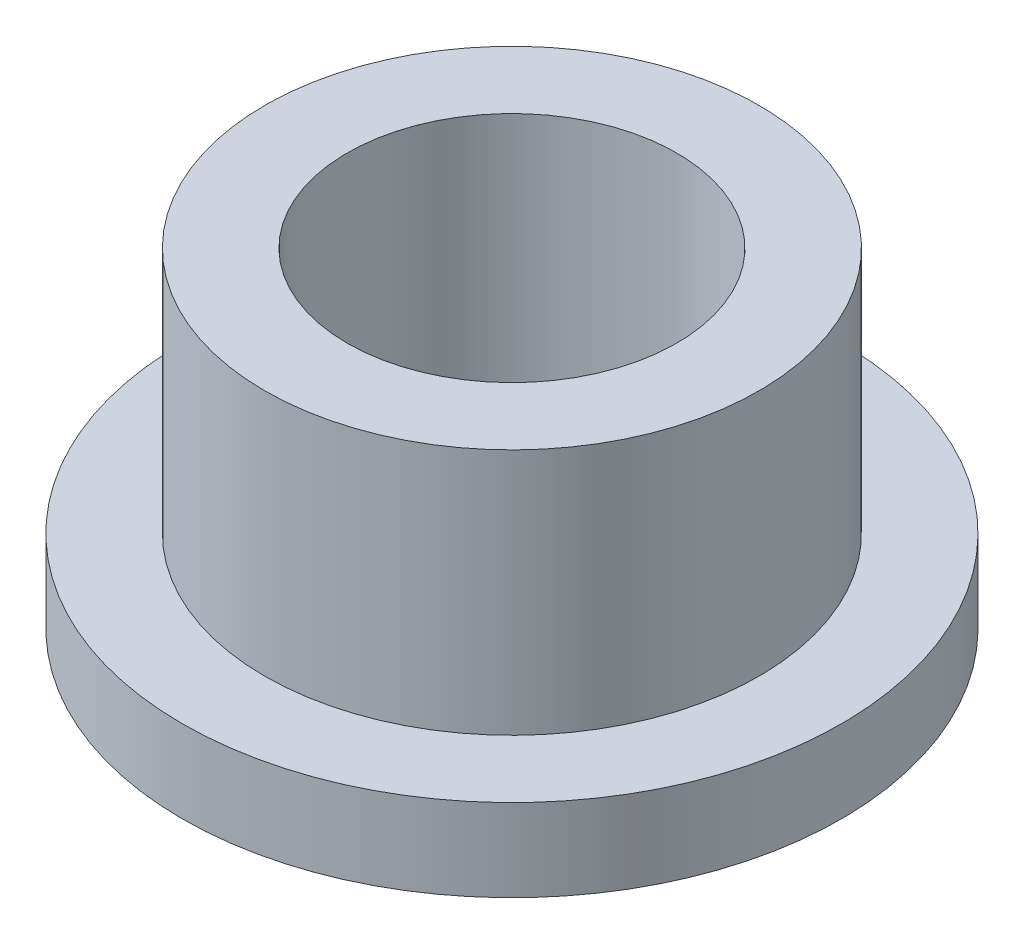
ISO-10303-21;
HEADER;
FILE_DESCRIPTION(('STEP AP214'),'2;1');
FILE_NAME('part.step','',(''),(''),'','','');
FILE_SCHEMA(('AUTOMOTIVE_DESIGN { 1 0 10303 214 1 1 1 1 }'));
ENDSEC;
DATA;
#1=APPLICATION_CONTEXT('core data for automotive mechanical design processes');
#2=APPLICATION_PROTOCOL_DEFINITION('international standard','automotive_design',2000,#1);
#3=PRODUCT_CONTEXT('',#1,'mechanical');
#4=PRODUCT('Part','Part','',(#3));
#5=PRODUCT_RELATED_PRODUCT_CATEGORY('part','',(#4));
#6=PRODUCT_DEFINITION_FORMATION('','',#4);
#7=PRODUCT_DEFINITION_CONTEXT('part definition',#1,'design');
#8=PRODUCT_DEFINITION('design','',#6,#7);
#9=PRODUCT_DEFINITION_SHAPE('','',#8);
#10=(LENGTH_UNIT() NAMED_UNIT(*) SI_UNIT(.MILLI.,.METRE.));
#11=(NAMED_UNIT(*) PLANE_ANGLE_UNIT() SI_UNIT($,.RADIAN.));
#12=(NAMED_UNIT(*) SI_UNIT($,.STERADIAN.) SOLID_ANGLE_UNIT());
#13=UNCERTAINTY_MEASURE_WITH_UNIT(LENGTH_MEASURE(1.E-05),#10,'distance_accuracy_value','');
#14=(GEOMETRIC_REPRESENTATION_CONTEXT(3) GLOBAL_UNCERTAINTY_ASSIGNED_CONTEXT((#13)) GLOBAL_UNIT_ASSIGNED_CONTEXT((#10,
#11,#12)) REPRESENTATION_CONTEXT('',''));
#15=CARTESIAN_POINT('',(0.,0.,0.));
#16=DIRECTION('',(0.,0.,1.));
#17=DIRECTION('',(1.,0.,0.));
#18=AXIS2_PLACEMENT_3D('',#15,#16,#17);
#19=CARTESIAN_POINT('',(0.,1.5875,0.));
#20=DIRECTION('',(0.,1.,0.));
#21=DIRECTION('',(0.,0.,1.));
#22=AXIS2_PLACEMENT_3D('',#19,#20,#21);
#23=PLANE('',#22);
#24=CARTESIAN_POINT('',(0.,1.5875,0.));
#25=DIRECTION('',(0.,1.,0.));
#26=DIRECTION('',(0.,0.,1.));
#27=AXIS2_PLACEMENT_3D('',#24,#25,#26);
#28=CIRCLE('',#27,6.35);
#29=CARTESIAN_POINT('',(0.,1.5875,6.35));
#30=VERTEX_POINT('',#29);
#31=EDGE_CURVE('E10',#30,#30,#28,.T.);
#32=ORIENTED_EDGE('',*,*,#31,.T.);
#33=EDGE_LOOP('',(#32));
#34=FACE_BOUND('',#33,.T.);
#35=CARTESIAN_POINT('',(0.,1.5875,0.));
#36=DIRECTION('',(0.,1.,0.));
#37=DIRECTION('',(0.,0.,1.));
#38=AXIS2_PLACEMENT_3D('',#35,#36,#37);
#39=CIRCLE('',#38,4.7625);
#40=CARTESIAN_POINT('',(0.,1.5875,4.7625));
#41=VERTEX_POINT('',#40);
#42=EDGE_CURVE('E45',#41,#41,#39,.F.);
#43=ORIENTED_EDGE('',*,*,#42,.T.);
#44=EDGE_LOOP('',(#43));
#45=FACE_BOUND('',#44,.T.);
#46=ADVANCED_FACE('F30',(#34,#45),#23,.T.);
#47=CARTESIAN_POINT('',(0.,0.,0.));
#48=DIRECTION('',(0.,1.,0.));
#49=DIRECTION('',(0.,0.,1.));
#50=AXIS2_PLACEMENT_3D('',#47,#48,#49);
#51=PLANE('',#50);
#52=CARTESIAN_POINT('',(0.,0.,0.));
#53=DIRECTION('',(0.,1.,0.));
#54=DIRECTION('',(0.,0.,1.));
#55=AXIS2_PLACEMENT_3D('',#52,#53,#54);
#56=CIRCLE('',#55,3.175);
#57=CARTESIAN_POINT('',(0.,0.,3.175));
#58=VERTEX_POINT('',#57);
#59=EDGE_CURVE('E41',#58,#58,#56,.T.);
#60=ORIENTED_EDGE('',*,*,#59,.T.);
#61=EDGE_LOOP('',(#60));
#62=FACE_BOUND('',#61,.T.);
#63=CARTESIAN_POINT('',(0.,0.,0.));
#64=DIRECTION('',(0.,1.,0.));
#65=DIRECTION('',(0.,0.,1.));
#66=AXIS2_PLACEMENT_3D('',#63,#64,#65);
#67=CIRCLE('',#66,6.35);
#68=CARTESIAN_POINT('',(0.,0.,6.35));
#69=VERTEX_POINT('',#68);
#70=EDGE_CURVE('E34',#69,#69,#67,.T.);
#71=ORIENTED_EDGE('',*,*,#70,.F.);
#72=EDGE_LOOP('',(#71));
#73=FACE_BOUND('',#72,.T.);
#74=ADVANCED_FACE('F71',(#62,#73),#51,.F.);
#75=CARTESIAN_POINT('',(0.,1.5875,0.));
#76=DIRECTION('',(0.,-1.,0.));
#77=DIRECTION('',(0.,0.,-1.));
#78=AXIS2_PLACEMENT_3D('',#75,#76,#77);
#79=CYLINDRICAL_SURFACE('',#78,6.35);
#80=ORIENTED_EDGE('',*,*,#31,.F.);
#81=EDGE_LOOP('',(#80));
#82=FACE_BOUND('',#81,.T.);
#83=ORIENTED_EDGE('',*,*,#70,.T.);
#84=EDGE_LOOP('',(#83));
#85=FACE_BOUND('',#84,.T.);
#86=ADVANCED_FACE('F32',(#82,#85),#79,.T.);
#87=CARTESIAN_POINT('',(0.,1.5875,0.));
#88=DIRECTION('',(0.,-1.,0.));
#89=DIRECTION('',(0.,0.,-1.));
#90=AXIS2_PLACEMENT_3D('',#87,#88,#89);
#91=CYLINDRICAL_SURFACE('',#90,3.175);
#92=ORIENTED_EDGE('',*,*,#59,.F.);
#93=EDGE_LOOP('',(#92));
#94=FACE_BOUND('',#93,.T.);
#95=CARTESIAN_POINT('',(0.,6.35,0.));
#96=DIRECTION('',(0.,1.,0.));
#97=DIRECTION('',(0.,0.,1.));
#98=AXIS2_PLACEMENT_3D('',#95,#96,#97);
#99=CIRCLE('',#98,3.175);
#100=CARTESIAN_POINT('',(0.,6.35,3.175));
#101=VERTEX_POINT('',#100);
#102=EDGE_CURVE('E51',#101,#101,#99,.T.);
#103=ORIENTED_EDGE('',*,*,#102,.T.);
#104=EDGE_LOOP('',(#103));
#105=FACE_BOUND('',#104,.T.);
#106=ADVANCED_FACE('F55',(#94,#105),#91,.F.);
#107=CARTESIAN_POINT('',(0.,6.35,0.));
#108=DIRECTION('',(0.,1.,0.));
#109=DIRECTION('',(0.,0.,1.));
#110=AXIS2_PLACEMENT_3D('',#107,#108,#109);
#111=PLANE('',#110);
#112=CARTESIAN_POINT('',(0.,6.35,0.));
#113=DIRECTION('',(0.,1.,0.));
#114=DIRECTION('',(0.,0.,1.));
#115=AXIS2_PLACEMENT_3D('',#112,#113,#114);
#116=CIRCLE('',#115,4.7625);
#117=CARTESIAN_POINT('',(0.,6.35,4.7625));
#118=VERTEX_POINT('',#117);
#119=EDGE_CURVE('E48',#118,#118,#116,.T.);
#120=ORIENTED_EDGE('',*,*,#119,.T.);
#121=EDGE_LOOP('',(#120));
#122=FACE_BOUND('',#121,.T.);
#123=ORIENTED_EDGE('',*,*,#102,.F.);
#124=EDGE_LOOP('',(#123));
#125=FACE_BOUND('',#124,.T.);
#126=ADVANCED_FACE('F57',(#122,#125),#111,.T.);
#127=CARTESIAN_POINT('',(0.,6.35,0.));
#128=DIRECTION('',(0.,-1.,0.));
#129=DIRECTION('',(0.,0.,-1.));
#130=AXIS2_PLACEMENT_3D('',#127,#128,#129);
#131=CYLINDRICAL_SURFACE('',#130,4.7625);
#132=ORIENTED_EDGE('',*,*,#42,.F.);
#133=EDGE_LOOP('',(#132));
#134=FACE_BOUND('',#133,.T.);
#135=ORIENTED_EDGE('',*,*,#119,.F.);
#136=EDGE_LOOP('',(#135));
#137=FACE_BOUND('',#136,.T.);
#138=ADVANCED_FACE('F59',(#134,#137),#131,.T.);
#139=CLOSED_SHELL('',(#46,#74,#86,#106,#126,#138));
#140=MANIFOLD_SOLID_BREP('B2',#139);
#141=ADVANCED_BREP_SHAPE_REPRESENTATION('',(#18,#140),#14);
#142=SHAPE_DEFINITION_REPRESENTATION(#9,#141);
ENDSEC;
END-ISO-10303-21;
